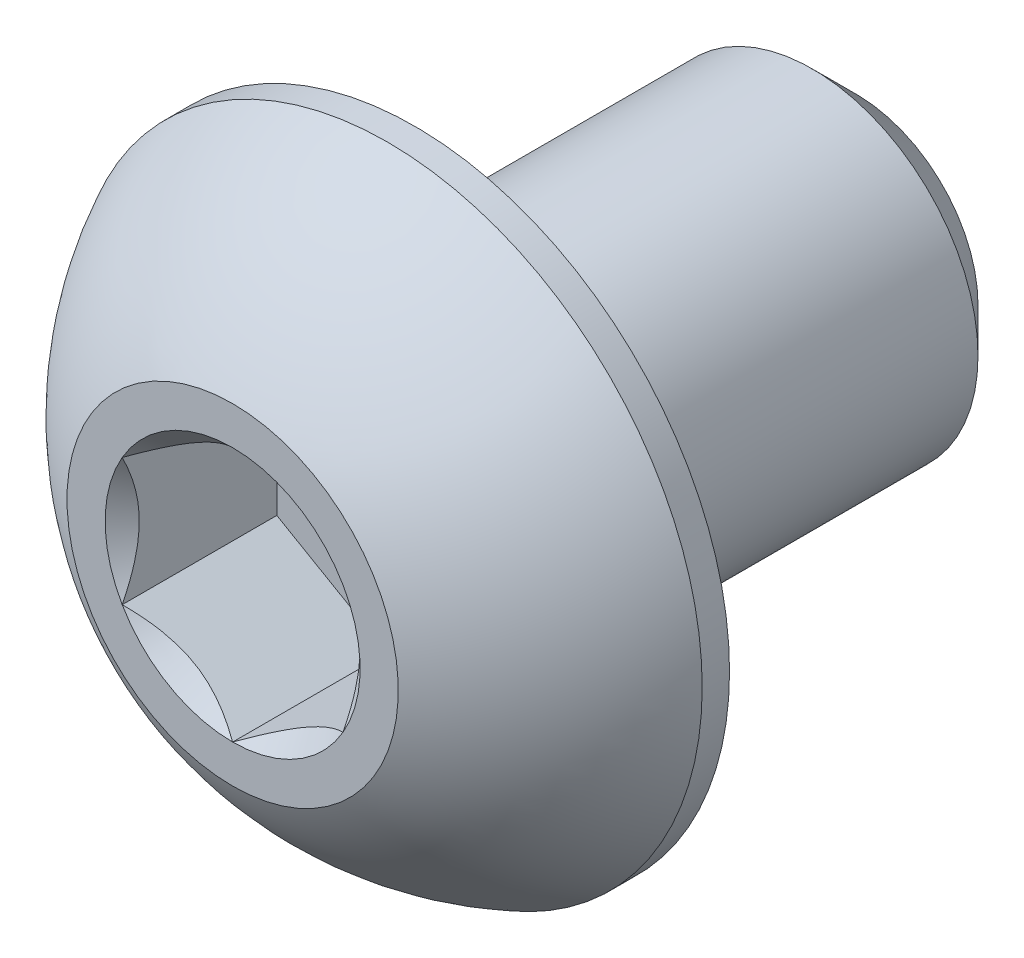
ISO-10303-21;
HEADER;
FILE_DESCRIPTION(('STEP AP214'),'2;1');
FILE_NAME('part.step','',(''),(''),'','','');
FILE_SCHEMA(('AUTOMOTIVE_DESIGN { 1 0 10303 214 1 1 1 1 }'));
ENDSEC;
DATA;
#1=APPLICATION_CONTEXT('core data for automotive mechanical design processes');
#2=APPLICATION_PROTOCOL_DEFINITION('international standard','automotive_design',2000,#1);
#3=PRODUCT_CONTEXT('',#1,'mechanical');
#4=PRODUCT('Part','Part','',(#3));
#5=PRODUCT_RELATED_PRODUCT_CATEGORY('part','',(#4));
#6=PRODUCT_DEFINITION_FORMATION('','',#4);
#7=PRODUCT_DEFINITION_CONTEXT('part definition',#1,'design');
#8=PRODUCT_DEFINITION('design','',#6,#7);
#9=PRODUCT_DEFINITION_SHAPE('','',#8);
#10=(LENGTH_UNIT() NAMED_UNIT(*) SI_UNIT(.MILLI.,.METRE.));
#11=(NAMED_UNIT(*) PLANE_ANGLE_UNIT() SI_UNIT($,.RADIAN.));
#12=(NAMED_UNIT(*) SI_UNIT($,.STERADIAN.) SOLID_ANGLE_UNIT());
#13=UNCERTAINTY_MEASURE_WITH_UNIT(LENGTH_MEASURE(1.E-05),#10,'distance_accuracy_value','');
#14=(GEOMETRIC_REPRESENTATION_CONTEXT(3) GLOBAL_UNCERTAINTY_ASSIGNED_CONTEXT((#13)) GLOBAL_UNIT_ASSIGNED_CONTEXT((#10,
#11,#12)) REPRESENTATION_CONTEXT('',''));
#15=CARTESIAN_POINT('',(0.,0.,0.));
#16=DIRECTION('',(0.,0.,1.));
#17=DIRECTION('',(1.,0.,0.));
#18=AXIS2_PLACEMENT_3D('',#15,#16,#17);
#19=CARTESIAN_POINT('',(0.,0.,2.825));
#20=DIRECTION('',(0.,0.,-1.));
#21=DIRECTION('',(-1.,0.,0.));
#22=AXIS2_PLACEMENT_3D('',#19,#20,#21);
#23=PLANE('',#22);
#24=CARTESIAN_POINT('',(0.,0.,2.825));
#25=DIRECTION('',(0.,0.,1.));
#26=DIRECTION('',(1.,0.,0.));
#27=AXIS2_PLACEMENT_3D('',#24,#25,#26);
#28=CIRCLE('',#27,1.15470053837925);
#29=CARTESIAN_POINT('',(-1.,0.577350269189626,2.825));
#30=VERTEX_POINT('',#29);
#31=CARTESIAN_POINT('',(-1.,-0.577350269189626,2.825));
#32=VERTEX_POINT('',#31);
#33=EDGE_CURVE('E134',#30,#32,#28,.T.);
#34=ORIENTED_EDGE('',*,*,#33,.F.);
#35=CARTESIAN_POINT('',(0.,1.15470053837925,2.825));
#36=VERTEX_POINT('',#35);
#37=EDGE_CURVE('E106',#36,#30,#28,.T.);
#38=ORIENTED_EDGE('',*,*,#37,.F.);
#39=CARTESIAN_POINT('',(1.,0.577350269189626,2.825));
#40=VERTEX_POINT('',#39);
#41=EDGE_CURVE('E97',#40,#36,#28,.T.);
#42=ORIENTED_EDGE('',*,*,#41,.F.);
#43=CARTESIAN_POINT('',(1.,-0.577350269189626,2.825));
#44=VERTEX_POINT('',#43);
#45=EDGE_CURVE('E58',#44,#40,#28,.T.);
#46=ORIENTED_EDGE('',*,*,#45,.F.);
#47=CARTESIAN_POINT('',(0.,-1.15470053837925,2.825));
#48=VERTEX_POINT('',#47);
#49=EDGE_CURVE('E65',#48,#44,#28,.T.);
#50=ORIENTED_EDGE('',*,*,#49,.F.);
#51=EDGE_CURVE('E135',#32,#48,#28,.T.);
#52=ORIENTED_EDGE('',*,*,#51,.F.);
#53=EDGE_LOOP('',(#34,#38,#42,#46,#50,#52));
#54=FACE_BOUND('',#53,.T.);
#55=CARTESIAN_POINT('',(0.,0.,2.825));
#56=DIRECTION('',(0.,0.,1.));
#57=DIRECTION('',(1.,0.,0.));
#58=AXIS2_PLACEMENT_3D('',#55,#56,#57);
#59=CIRCLE('',#58,1.5);
#60=CARTESIAN_POINT('',(0.,1.5,2.825));
#61=VERTEX_POINT('',#60);
#62=EDGE_CURVE('E52',#61,#61,#59,.T.);
#63=ORIENTED_EDGE('',*,*,#62,.T.);
#64=EDGE_LOOP('',(#63));
#65=FACE_BOUND('',#64,.T.);
#66=ADVANCED_FACE('F39',(#54,#65),#23,.F.);
#67=CARTESIAN_POINT('',(0.,0.,0.0301671122994625));
#68=DIRECTION('',(0.,0.,1.));
#69=DIRECTION('',(0.,1.,0.));
#70=AXIS2_PLACEMENT_3D('',#67,#68,#69);
#71=SPHERICAL_SURFACE('',#70,3.17192226735973);
#72=CARTESIAN_POINT('',(0.,0.,1.4225));
#73=DIRECTION('',(0.,0.,1.));
#74=DIRECTION('',(1.,0.,0.));
#75=AXIS2_PLACEMENT_3D('',#72,#73,#74);
#76=CIRCLE('',#75,2.85);
#77=CARTESIAN_POINT('',(0.,2.85,1.4225));
#78=VERTEX_POINT('',#77);
#79=EDGE_CURVE('E217',#78,#78,#76,.T.);
#80=CARTESIAN_POINT('',(0.,1.5,2.825));
#81=CARTESIAN_POINT('',(0.,1.5181600798921,2.81525343052663));
#82=CARTESIAN_POINT('',(0.,1.53622513742981,2.80532981527615));
#83=CARTESIAN_POINT('',(0.,1.57215840256594,2.78513236887069));
#84=CARTESIAN_POINT('',(0.,1.59002661016438,2.7748585377157));
#85=CARTESIAN_POINT('',(0.,1.6255593701915,2.75396453515098));
#86=CARTESIAN_POINT('',(0.,1.64322392262019,2.74334436374123));
#87=CARTESIAN_POINT('',(0.,1.67834266450262,2.72176172357303));
#88=CARTESIAN_POINT('',(0.,1.69579685395635,2.71079925481458));
#89=CARTESIAN_POINT('',(0.,1.73048823664554,2.68853618336439));
#90=CARTESIAN_POINT('',(0.,1.74772542988098,2.67723558067265));
#91=CARTESIAN_POINT('',(0.,1.78197627078176,2.65430053581285));
#92=CARTESIAN_POINT('',(0.,1.79898991844709,2.64266609364478));
#93=CARTESIAN_POINT('',(0.,1.83278720341135,2.61906779045309));
#94=CARTESIAN_POINT('',(0.,1.84957084071028,2.60710392942946));
#95=CARTESIAN_POINT('',(0.,1.88290172764636,2.58285133450125));
#96=CARTESIAN_POINT('',(0.,1.8994489772835,2.57056260059666));
#97=CARTESIAN_POINT('',(0.,1.93230080139369,2.54566492927458));
#98=CARTESIAN_POINT('',(0.,1.94860537586673,2.53305599185708));
#99=CARTESIAN_POINT('',(0.,1.98096565436365,2.50752270455889));
#100=CARTESIAN_POINT('',(0.,1.99702135838753,2.49459835467819));
#101=CARTESIAN_POINT('',(0.,2.02887779526296,2.46843915334777));
#102=CARTESIAN_POINT('',(0.,2.04467852811452,2.45520430189805));
#103=CARTESIAN_POINT('',(0.,2.07601901880464,2.42842912630669));
#104=CARTESIAN_POINT('',(0.,2.09155877664321,2.41488880216506));
#105=CARTESIAN_POINT('',(0.,2.12237141262985,2.38750782613789));
#106=CARTESIAN_POINT('',(0.,2.13764429077792,2.37366717425237));
#107=CARTESIAN_POINT('',(0.,2.16791736411296,2.34569080180173));
#108=CARTESIAN_POINT('',(0.,2.18291755929993,2.33155508123663));
#109=CARTESIAN_POINT('',(0.,2.21263956705414,2.30299394260905));
#110=CARTESIAN_POINT('',(0.,2.22736137962139,2.28856852454658));
#111=CARTESIAN_POINT('',(0.,2.2565210282552,2.25943347218353));
#112=CARTESIAN_POINT('',(0.,2.27095886432177,2.24472383788295));
#113=CARTESIAN_POINT('',(0.,2.2995450739765,2.21502594229721));
#114=CARTESIAN_POINT('',(0.,2.31369344756465,2.20003768101205));
#115=CARTESIAN_POINT('',(0.,2.34169535627252,2.16978822658124));
#116=CARTESIAN_POINT('',(0.,2.35554889139223,2.15452703343559));
#117=CARTESIAN_POINT('',(0.,2.38295585920366,2.12373751411442));
#118=CARTESIAN_POINT('',(0.,2.39650929189537,2.1082091879389));
#119=CARTESIAN_POINT('',(0.,2.42331090492182,2.07689130289176));
#120=CARTESIAN_POINT('',(0.,2.43655908525656,2.06110174402014));
#121=CARTESIAN_POINT('',(0.,2.46274515962755,2.02926739317577));
#122=CARTESIAN_POINT('',(0.,2.47568305366379,2.01322260120302));
#123=CARTESIAN_POINT('',(0.,2.5012436393965,1.98088388073288));
#124=CARTESIAN_POINT('',(0.,2.51386633109298,1.96458995223548));
#125=CARTESIAN_POINT('',(0.,2.53879171587278,1.9317591499574));
#126=CARTESIAN_POINT('',(0.,2.55109440895612,1.91522227617672));
#127=CARTESIAN_POINT('',(0.,2.57537512182785,1.88191186688636));
#128=CARTESIAN_POINT('',(0.,2.58735314161625,1.8651383313767));
#129=CARTESIAN_POINT('',(0.,2.61097995657956,1.83136097210576));
#130=CARTESIAN_POINT('',(0.,2.62262875175448,1.81435714834448));
#131=CARTESIAN_POINT('',(0.,2.64559269128198,1.78012567355775));
#132=CARTESIAN_POINT('',(0.,2.65690783563458,1.76289802253229));
#133=CARTESIAN_POINT('',(0.,2.67920017403639,1.72822543922701));
#134=CARTESIAN_POINT('',(0.,2.69017736808561,1.71078050694718));
#135=CARTESIAN_POINT('',(0.,2.711789634999,1.67567998980005));
#136=CARTESIAN_POINT('',(0.,2.72242470786316,1.65802440493275));
#137=CARTESIAN_POINT('',(0.,2.74334869082117,1.62250929096058));
#138=CARTESIAN_POINT('',(0.,2.75363760091502,1.60464976185571));
#139=CARTESIAN_POINT('',(0.,2.77386535089241,1.56873354659176));
#140=CARTESIAN_POINT('',(0.,2.78380419077596,1.55067686043268));
#141=CARTESIAN_POINT('',(0.,2.80332801615778,1.51437318815589));
#142=CARTESIAN_POINT('',(0.,2.81291300165605,1.49612620203818));
#143=CARTESIAN_POINT('',(0.,2.83172550494215,1.45944887791611));
#144=CARTESIAN_POINT('',(0.,2.84095302272998,1.44101853991173));
#145=CARTESIAN_POINT('',(0.,2.85,1.4225));
#146=B_SPLINE_CURVE_WITH_KNOTS('',3,(#80,#81,#82,#83,#84,#85,#86,#87,#88,#89,#90,#91,#92,#93,
#94,#95,#96,#97,#98,#99,#100,#101,#102,#103,#104,#105,#106,#107,#108,#109,#110,#111,#112,#113,
#114,#115,#116,#117,#118,#119,#120,#121,#122,#123,#124,#125,#126,#127,#128,#129,#130,#131,#132,
#133,#134,#135,#136,#137,#138,#139,#140,#141,#142,#143,#144,#145),.UNSPECIFIED.,.F.,.F.,(4,2,2,
2,2,2,2,2,2,2,2,2,2,2,2,2,2,2,2,2,2,2,2,2,2,2,2,2,2,2,2,2,4),(0.,0.0618298941826977,
0.123659788365397,0.185489682548094,0.247319576730792,0.309149470913491,0.370979365096189,
0.432809259278887,0.494639153461586,0.556469047644284,0.618298941826982,0.68012883600968,
0.741958730192378,0.803788624375077,0.865618518557774,0.927448412740472,0.989278306923171,
1.05110820110587,1.11293809528857,1.17476798947127,1.23659788365396,1.29842777783666,
1.36025767201936,1.42208756620206,1.48391746038476,1.54574735456745,1.60757724875015,
1.66940714293285,1.73123703711555,1.79306693129825,1.85489682548095,1.91672671966364,
1.97855661384634),.UNSPECIFIED.);
#147=EDGE_CURVE('BSEAM222',#61,#78,#146,.T.);
#148=ORIENTED_EDGE('',*,*,#62,.F.);
#149=ORIENTED_EDGE('',*,*,#79,.T.);
#150=ORIENTED_EDGE('',*,*,#147,.T.);
#151=ORIENTED_EDGE('',*,*,#147,.F.);
#152=EDGE_LOOP('',(#148,#150,#149,#151));
#153=FACE_BOUND('',#152,.T.);
#154=ADVANCED_FACE('F222',(#153),#71,.T.);
#155=CARTESIAN_POINT('',(0.,0.,2.825));
#156=DIRECTION('',(0.,0.,1.));
#157=DIRECTION('',(1.,0.,0.));
#158=AXIS2_PLACEMENT_3D('',#155,#156,#157);
#159=CYLINDRICAL_SURFACE('',#158,2.85);
#160=ORIENTED_EDGE('',*,*,#79,.F.);
#161=EDGE_LOOP('',(#160));
#162=FACE_BOUND('',#161,.T.);
#163=CARTESIAN_POINT('',(0.,0.,1.175));
#164=DIRECTION('',(0.,0.,1.));
#165=DIRECTION('',(1.,0.,0.));
#166=AXIS2_PLACEMENT_3D('',#163,#164,#165);
#167=CIRCLE('',#166,2.85);
#168=CARTESIAN_POINT('',(2.85,0.,1.175));
#169=VERTEX_POINT('',#168);
#170=EDGE_CURVE('E214',#169,#169,#167,.T.);
#171=ORIENTED_EDGE('',*,*,#170,.T.);
#172=EDGE_LOOP('',(#171));
#173=FACE_BOUND('',#172,.T.);
#174=ADVANCED_FACE('F225',(#162,#173),#159,.T.);
#175=CARTESIAN_POINT('',(0.,1.5,1.175));
#176=DIRECTION('',(0.,0.,1.));
#177=DIRECTION('',(1.,0.,0.));
#178=AXIS2_PLACEMENT_3D('',#175,#176,#177);
#179=PLANE('',#178);
#180=ORIENTED_EDGE('',*,*,#170,.F.);
#181=EDGE_LOOP('',(#180));
#182=FACE_BOUND('',#181,.T.);
#183=CARTESIAN_POINT('',(0.,0.,1.175));
#184=DIRECTION('',(0.,0.,1.));
#185=DIRECTION('',(1.,0.,0.));
#186=AXIS2_PLACEMENT_3D('',#183,#184,#185);
#187=CIRCLE('',#186,1.5);
#188=CARTESIAN_POINT('',(1.5,0.,1.175));
#189=VERTEX_POINT('',#188);
#190=EDGE_CURVE('E211',#189,#189,#187,.T.);
#191=ORIENTED_EDGE('',*,*,#190,.T.);
#192=EDGE_LOOP('',(#191));
#193=FACE_BOUND('',#192,.T.);
#194=ADVANCED_FACE('F230',(#182,#193),#179,.F.);
#195=CARTESIAN_POINT('',(0.,0.,2.825));
#196=DIRECTION('',(0.,0.,1.));
#197=DIRECTION('',(1.,0.,0.));
#198=AXIS2_PLACEMENT_3D('',#195,#196,#197);
#199=CYLINDRICAL_SURFACE('',#198,1.5);
#200=ORIENTED_EDGE('',*,*,#190,.F.);
#201=EDGE_LOOP('',(#200));
#202=FACE_BOUND('',#201,.T.);
#203=CARTESIAN_POINT('',(0.,0.,-2.425));
#204=DIRECTION('',(0.,0.,1.));
#205=DIRECTION('',(1.,0.,0.));
#206=AXIS2_PLACEMENT_3D('',#203,#204,#205);
#207=CIRCLE('',#206,1.5);
#208=CARTESIAN_POINT('',(1.5,0.,-2.425));
#209=VERTEX_POINT('',#208);
#210=EDGE_CURVE('E208',#209,#209,#207,.T.);
#211=ORIENTED_EDGE('',*,*,#210,.T.);
#212=EDGE_LOOP('',(#211));
#213=FACE_BOUND('',#212,.T.);
#214=ADVANCED_FACE('F236',(#202,#213),#199,.T.);
#215=CARTESIAN_POINT('',(0.,0.,-2.825));
#216=DIRECTION('',(0.,0.,1.));
#217=DIRECTION('',(1.,0.,0.));
#218=AXIS2_PLACEMENT_3D('',#215,#216,#217);
#219=CONICAL_SURFACE('',#218,1.1,0.785398163397444);
#220=ORIENTED_EDGE('',*,*,#210,.F.);
#221=EDGE_LOOP('',(#220));
#222=FACE_BOUND('',#221,.T.);
#223=CARTESIAN_POINT('',(0.,0.,-2.825));
#224=DIRECTION('',(0.,0.,1.));
#225=DIRECTION('',(1.,0.,0.));
#226=AXIS2_PLACEMENT_3D('',#223,#224,#225);
#227=CIRCLE('',#226,1.1);
#228=CARTESIAN_POINT('',(1.1,0.,-2.825));
#229=VERTEX_POINT('',#228);
#230=EDGE_CURVE('E195',#229,#229,#227,.T.);
#231=ORIENTED_EDGE('',*,*,#230,.T.);
#232=EDGE_LOOP('',(#231));
#233=FACE_BOUND('',#232,.T.);
#234=ADVANCED_FACE('F242',(#222,#233),#219,.T.);
#235=CARTESIAN_POINT('',(0.,0.,-2.825));
#236=DIRECTION('',(0.,0.,1.));
#237=DIRECTION('',(1.,0.,0.));
#238=AXIS2_PLACEMENT_3D('',#235,#236,#237);
#239=PLANE('',#238);
#240=ORIENTED_EDGE('',*,*,#230,.F.);
#241=EDGE_LOOP('',(#240));
#242=FACE_BOUND('',#241,.T.);
#243=ADVANCED_FACE('F168',(#242),#239,.F.);
#244=CARTESIAN_POINT('',(0.,0.,2.825));
#245=DIRECTION('',(0.,0.,1.));
#246=DIRECTION('',(1.,0.,0.));
#247=AXIS2_PLACEMENT_3D('',#244,#245,#246);
#248=CONICAL_SURFACE('',#247,1.15470053837925,0.78539816339745);
#249=ORIENTED_EDGE('',*,*,#37,.T.);
#250=CARTESIAN_POINT('',(0.000200000000000047,1.15481600843309,2.82511548737261));
#251=CARTESIAN_POINT('',(-0.0341825950071806,1.13496520795026,2.80527793082573));
#252=CARTESIAN_POINT('',(-0.0691401181398248,1.11478247255942,2.78660502063889));
#253=CARTESIAN_POINT('',(-0.14042280295609,1.07362739529219,2.75241474272316));
#254=CARTESIAN_POINT('',(-0.176754750528984,1.0526511355808,2.73691640902346));
#255=CARTESIAN_POINT('',(-0.250016613803311,1.01035337909803,2.71036730714227));
#256=CARTESIAN_POINT('',(-0.286927851445414,0.989042666109241,2.69924977399693));
#257=CARTESIAN_POINT('',(-0.361562729310859,0.945952199282692,2.68211986577618));
#258=CARTESIAN_POINT('',(-0.399284088108636,0.924173762626597,2.67609469746667));
#259=CARTESIAN_POINT('',(-0.464292198417934,0.886641312640015,2.67066055496749));
#260=CARTESIAN_POINT('',(-0.491494371528172,0.870936130672276,2.66985693831673));
#261=CARTESIAN_POINT('',(-0.545846040669112,0.839556179862849,2.67120669941689));
#262=CARTESIAN_POINT('',(-0.572995523754876,0.823881418494924,2.6733607295472));
#263=CARTESIAN_POINT('',(-0.65405627732696,0.777080970599367,2.68411697212847));
#264=CARTESIAN_POINT('',(-0.707564140978427,0.746188191116431,2.69701455641536));
#265=CARTESIAN_POINT('',(-0.801476065143432,0.69196811641965,2.72814073060218));
#266=CARTESIAN_POINT('',(-0.842320523671834,0.668386557293372,2.74473779770184));
#267=CARTESIAN_POINT('',(-0.922409637381944,0.622147085933682,2.78212492468529));
#268=CARTESIAN_POINT('',(-0.961659010870438,0.599486449584576,2.8029013418174));
#269=CARTESIAN_POINT('',(-1.0002,0.577234799135789,2.82511548737261));
#270=B_SPLINE_CURVE_WITH_KNOTS('',3,(#250,#251,#252,#253,#254,#255,#256,#257,#258,#259,#260,
#261,#262,#263,#264,#265,#266,#267,#268,#269),.UNSPECIFIED.,.F.,.F.,(4,2,2,2,2,2,2,2,2,4),(0.,
0.133237676828559,0.26725222983449,0.3991370762693,0.530689603280768,0.624814864263846,
0.718960890149133,0.907306626112098,1.05710100361789,1.20641411519286),.UNSPECIFIED.);
#271=EDGE_CURVE('E11',#36,#30,#270,.T.);
#272=ORIENTED_EDGE('',*,*,#271,.F.);
#273=EDGE_LOOP('',(#249,#272));
#274=FACE_BOUND('',#273,.T.);
#275=ADVANCED_FACE('F110',(#274),#248,.F.);
#276=ORIENTED_EDGE('',*,*,#33,.T.);
#277=CARTESIAN_POINT('',(-1.,-1.15147208646462,3.19538567751386));
#278=CARTESIAN_POINT('',(-1.,-1.12343447988552,3.17421991987371));
#279=CARTESIAN_POINT('',(-1.,-1.09524064850697,3.15326169217591));
#280=CARTESIAN_POINT('',(-1.,-1.03847715644376,3.11184602223562));
#281=CARTESIAN_POINT('',(-1.,-1.00990740382975,3.09138870612366));
#282=CARTESIAN_POINT('',(-1.,-0.923120894333476,3.03060479495451));
#283=CARTESIAN_POINT('',(-1.,-0.864253173759059,2.9911922289614));
#284=CARTESIAN_POINT('',(-1.,-0.740809858258045,2.9138206642002));
#285=CARTESIAN_POINT('',(-1.,-0.676100255137807,2.87607303911434));
#286=CARTESIAN_POINT('',(-1.,-0.543448939049124,2.80702458755129));
#287=CARTESIAN_POINT('',(-1.,-0.475519112027779,2.77570202784686));
#288=CARTESIAN_POINT('',(-1.,-0.373555850333529,2.73738177888379));
#289=CARTESIAN_POINT('',(-1.,-0.341031989670907,2.72638359164216));
#290=CARTESIAN_POINT('',(-1.,-0.275199079052293,2.70699834214736));
#291=CARTESIAN_POINT('',(-1.,-0.241889975173933,2.6986114597767));
#292=CARTESIAN_POINT('',(-1.,-0.175247517042993,2.68502522071902));
#293=CARTESIAN_POINT('',(-1.,-0.141925568218175,2.67977079076797));
#294=CARTESIAN_POINT('',(-1.,-0.0749144362322789,2.67254868657089));
#295=CARTESIAN_POINT('',(-1.,-0.0412251978501617,2.67058151361051));
#296=CARTESIAN_POINT('',(-1.,0.0249580992634211,2.67008319839316));
#297=CARTESIAN_POINT('',(-1.,0.0574512826460395,2.67143026788863));
#298=CARTESIAN_POINT('',(-1.,0.122148505701867,2.67721648449898));
#299=CARTESIAN_POINT('',(-1.,0.154352610132927,2.68165492066153));
#300=CARTESIAN_POINT('',(-1.,0.21879989886764,2.6934568301452));
#301=CARTESIAN_POINT('',(-1.,0.251033743268954,2.70087054103851));
#302=CARTESIAN_POINT('',(-1.,0.314797132354919,2.71822894249867));
#303=CARTESIAN_POINT('',(-1.,0.346326735731004,2.72817342128883));
#304=CARTESIAN_POINT('',(-1.,0.445594187730205,2.76322348255434));
#305=CARTESIAN_POINT('',(-1.,0.511919139476036,2.79232085835672));
#306=CARTESIAN_POINT('',(-1.,0.641453244657532,2.8570153296865));
#307=CARTESIAN_POINT('',(-1.,0.704650133126344,2.89263577671524));
#308=CARTESIAN_POINT('',(-1.,0.825428490174986,2.96612390134693));
#309=CARTESIAN_POINT('',(-1.,0.883132947867684,3.00379194713546));
#310=CARTESIAN_POINT('',(-1.,0.968148853704565,3.06202285294316));
#311=CARTESIAN_POINT('',(-1.,0.996120570380284,3.08163847576285));
#312=CARTESIAN_POINT('',(-1.,1.05168177729901,3.12138851706127));
#313=CARTESIAN_POINT('',(-1.,1.079271369977,3.14152279219883));
#314=CARTESIAN_POINT('',(-1.,1.10670185346329,3.16187211907297));
#315=B_SPLINE_CURVE_WITH_KNOTS('',3,(#277,#278,#279,#280,#281,#282,#283,#284,#285,#286,#287,
#288,#289,#290,#291,#292,#293,#294,#295,#296,#297,#298,#299,#300,#301,#302,#303,#304,#305,#306,
#307,#308,#309,#310,#311,#312,#313,#314),.UNSPECIFIED.,.F.,.F.,(4,2,2,2,2,2,2,2,2,2,2,2,2,2,2,2,
2,2,4),(0.,0.10538645908329,0.210799187330124,0.423233611565468,0.647793540908503,
0.871580877738609,0.97449307418142,1.07741235827201,1.17846428203205,1.27953161415762,
1.3769408673961,1.47432772585408,1.57343322804293,1.67253043972851,1.88917353996827,
2.10660791038813,2.31323734249843,2.41572589232044,2.51818641476503),.UNSPECIFIED.);
#316=EDGE_CURVE('E105',#30,#32,#315,.F.);
#317=ORIENTED_EDGE('',*,*,#316,.F.);
#318=EDGE_LOOP('',(#276,#317));
#319=FACE_BOUND('',#318,.T.);
#320=ADVANCED_FACE('F255',(#319),#248,.F.);
#321=ORIENTED_EDGE('',*,*,#51,.T.);
#322=CARTESIAN_POINT('',(-1.0002,-0.577234799135788,2.82511548737261));
#323=CARTESIAN_POINT('',(-0.965817404992819,-0.597085599618621,2.80527793082573));
#324=CARTESIAN_POINT('',(-0.930859881860175,-0.617268335009456,2.78660502063889));
#325=CARTESIAN_POINT('',(-0.85957719704391,-0.658423412276686,2.75241474272316));
#326=CARTESIAN_POINT('',(-0.823245249471016,-0.67939967198808,2.73691640902346));
#327=CARTESIAN_POINT('',(-0.749983386196689,-0.721697428470846,2.71036730714226));
#328=CARTESIAN_POINT('',(-0.713072148554586,-0.743008141459636,2.69924977399693));
#329=CARTESIAN_POINT('',(-0.638437270689141,-0.786098608286186,2.68211986577618));
#330=CARTESIAN_POINT('',(-0.600715911891364,-0.807877044942281,2.67609469746667));
#331=CARTESIAN_POINT('',(-0.535707801582067,-0.845409494928862,2.67066055496749));
#332=CARTESIAN_POINT('',(-0.508505628471828,-0.861114676896601,2.66985693831673));
#333=CARTESIAN_POINT('',(-0.454153959330888,-0.892494627706028,2.67120669941689));
#334=CARTESIAN_POINT('',(-0.427004476245125,-0.908169389073953,2.6733607295472));
#335=CARTESIAN_POINT('',(-0.34594372267304,-0.95496983696951,2.68411697212847));
#336=CARTESIAN_POINT('',(-0.292435859021573,-0.985862616452447,2.69701455641535));
#337=CARTESIAN_POINT('',(-0.198523934856569,-1.04008269114923,2.72814073060218));
#338=CARTESIAN_POINT('',(-0.157679476328166,-1.06366425027551,2.74473779770184));
#339=CARTESIAN_POINT('',(-0.0775903626180565,-1.1099037216352,2.78212492468529));
#340=CARTESIAN_POINT('',(-0.0383409891295625,-1.1325643579843,2.8029013418174));
#341=CARTESIAN_POINT('',(0.000199999999999785,-1.15481600843309,2.82511548737261));
#342=B_SPLINE_CURVE_WITH_KNOTS('',3,(#322,#323,#324,#325,#326,#327,#328,#329,#330,#331,#332,
#333,#334,#335,#336,#337,#338,#339,#340,#341),.UNSPECIFIED.,.F.,.F.,(4,2,2,2,2,2,2,2,2,4),(0.,
0.133237676828559,0.26725222983449,0.3991370762693,0.530689603280768,0.624814864263846,
0.718960890149133,0.907306626112097,1.05710100361789,1.20641411519286),.UNSPECIFIED.);
#343=EDGE_CURVE('E144',#32,#48,#342,.T.);
#344=ORIENTED_EDGE('',*,*,#343,.F.);
#345=EDGE_LOOP('',(#321,#344));
#346=FACE_BOUND('',#345,.T.);
#347=ADVANCED_FACE('F272',(#346),#248,.F.);
#348=ORIENTED_EDGE('',*,*,#49,.T.);
#349=CARTESIAN_POINT('',(-0.000200000000000145,-1.15481600843309,2.82511548737261));
#350=CARTESIAN_POINT('',(0.0341825950071804,-1.13496520795026,2.80527793082573));
#351=CARTESIAN_POINT('',(0.0691401181398246,-1.11478247255942,2.78660502063889));
#352=CARTESIAN_POINT('',(0.140422802956089,-1.07362739529219,2.75241474272316));
#353=CARTESIAN_POINT('',(0.176754750528984,-1.0526511355808,2.73691640902346));
#354=CARTESIAN_POINT('',(0.250016613803311,-1.01035337909803,2.71036730714226));
#355=CARTESIAN_POINT('',(0.286927851445414,-0.98904266610924,2.69924977399692));
#356=CARTESIAN_POINT('',(0.361562729310859,-0.945952199282691,2.68211986577618));
#357=CARTESIAN_POINT('',(0.399284088108636,-0.924173762626596,2.67609469746667));
#358=CARTESIAN_POINT('',(0.464292198417933,-0.886641312640014,2.67066055496749));
#359=CARTESIAN_POINT('',(0.491494371528172,-0.870936130672275,2.66985693831673));
#360=CARTESIAN_POINT('',(0.545846040669112,-0.839556179862848,2.67120669941689));
#361=CARTESIAN_POINT('',(0.572995523754876,-0.823881418494923,2.6733607295472));
#362=CARTESIAN_POINT('',(0.65405627732696,-0.777080970599366,2.68411697212847));
#363=CARTESIAN_POINT('',(0.707564140978427,-0.74618819111643,2.69701455641535));
#364=CARTESIAN_POINT('',(0.801476065143431,-0.691968116419649,2.72814073060218));
#365=CARTESIAN_POINT('',(0.842320523671834,-0.668386557293371,2.74473779770184));
#366=CARTESIAN_POINT('',(0.922409637381944,-0.622147085933681,2.78212492468529));
#367=CARTESIAN_POINT('',(0.961659010870438,-0.599486449584575,2.8029013418174));
#368=CARTESIAN_POINT('',(1.0002,-0.577234799135788,2.82511548737261));
#369=B_SPLINE_CURVE_WITH_KNOTS('',3,(#349,#350,#351,#352,#353,#354,#355,#356,#357,#358,#359,
#360,#361,#362,#363,#364,#365,#366,#367,#368),.UNSPECIFIED.,.F.,.F.,(4,2,2,2,2,2,2,2,2,4),(0.,
0.133237676828559,0.26725222983449,0.3991370762693,0.530689603280768,0.624814864263846,
0.718960890149133,0.907306626112097,1.05710100361789,1.20641411519286),.UNSPECIFIED.);
#370=EDGE_CURVE('E352',#48,#44,#369,.T.);
#371=ORIENTED_EDGE('',*,*,#370,.F.);
#372=EDGE_LOOP('',(#348,#371));
#373=FACE_BOUND('',#372,.T.);
#374=ADVANCED_FACE('F279',(#373),#248,.F.);
#375=ORIENTED_EDGE('',*,*,#45,.T.);
#376=CARTESIAN_POINT('',(1.,-1.15147208663215,3.19538567764035));
#377=CARTESIAN_POINT('',(1.,-1.12343448004835,3.17421991999533));
#378=CARTESIAN_POINT('',(1.,-1.09524064866509,3.15326169229266));
#379=CARTESIAN_POINT('',(1.,-1.0384771565924,3.11184602234267));
#380=CARTESIAN_POINT('',(1.,-1.00990740397362,3.09138870622587));
#381=CARTESIAN_POINT('',(1.,-0.923120894462775,3.03060479504212));
#382=CARTESIAN_POINT('',(1.,-0.864253173878444,2.99119222903932));
#383=CARTESIAN_POINT('',(1.,-0.74080985835581,2.91382066425819));
#384=CARTESIAN_POINT('',(1.,-0.676100255223808,2.87607303916216));
#385=CARTESIAN_POINT('',(1.,-0.543448939110597,2.80702458758025));
#386=CARTESIAN_POINT('',(1.,-0.475519112076495,2.77570202786713));
#387=CARTESIAN_POINT('',(1.,-0.373555850372648,2.7373817788976));
#388=CARTESIAN_POINT('',(1.,-0.341031989714046,2.72638359165621));
#389=CARTESIAN_POINT('',(1.,-0.275199079103601,2.70699834216111));
#390=CARTESIAN_POINT('',(1.,-0.241889975229392,2.69861145978989));
#391=CARTESIAN_POINT('',(1.,-0.175247517106615,2.68502522073014));
#392=CARTESIAN_POINT('',(1.,-0.141925568285807,2.67977079077761));
#393=CARTESIAN_POINT('',(1.,-0.0749144363078009,2.67254868657667));
#394=CARTESIAN_POINT('',(1.,-0.0412251979295626,2.67058151361391));
#395=CARTESIAN_POINT('',(1.,0.0249580991768645,2.67008319839111));
#396=CARTESIAN_POINT('',(1.,0.057451282556196,2.67143026788357));
#397=CARTESIAN_POINT('',(1.,0.122148505605779,2.67721648448742));
#398=CARTESIAN_POINT('',(1.,0.154352610033881,2.68165492064648));
#399=CARTESIAN_POINT('',(1.,0.218799898762755,2.69345683012285));
#400=CARTESIAN_POINT('',(1.,0.251033743161196,2.70087054101231));
#401=CARTESIAN_POINT('',(1.,0.314797132241694,2.71822894246471));
#402=CARTESIAN_POINT('',(1.,0.346326735615184,2.72817342125094));
#403=CARTESIAN_POINT('',(1.,0.445594187589164,2.76322348249794));
#404=CARTESIAN_POINT('',(1.,0.511919139313635,2.7923208582833));
#405=CARTESIAN_POINT('',(1.,0.641453244454049,2.85701532957715));
#406=CARTESIAN_POINT('',(1.,0.704650132903151,2.89263577658696));
#407=CARTESIAN_POINT('',(1.,0.825428489916356,2.96612390118245));
#408=CARTESIAN_POINT('',(1.,0.883132947593201,3.00379194695385));
#409=CARTESIAN_POINT('',(1.,0.968148853406641,3.06202285273595));
#410=CARTESIAN_POINT('',(1.,0.99612057007466,3.08163847554718));
#411=CARTESIAN_POINT('',(1.,1.05168177697804,3.12138851682867));
#412=CARTESIAN_POINT('',(1.,1.07927136964838,3.14152279195778));
#413=CARTESIAN_POINT('',(1.,1.10670185312703,3.16187211882347));
#414=B_SPLINE_CURVE_WITH_KNOTS('',3,(#376,#377,#378,#379,#380,#381,#382,#383,#384,#385,#386,
#387,#388,#389,#390,#391,#392,#393,#394,#395,#396,#397,#398,#399,#400,#401,#402,#403,#404,#405,
#406,#407,#408,#409,#410,#411,#412,#413),.UNSPECIFIED.,.F.,.F.,(4,2,2,2,2,2,2,2,2,2,2,2,2,2,2,2,
2,2,4),(0.,0.10538645910335,0.210799187370249,0.423233611646473,0.647793541035351,
0.871580877910865,0.974493074342054,1.07741235842104,1.17846428216995,1.27953161428439,
1.37694086751269,1.47432772596047,1.57343322813835,1.67253043981296,1.88917353997386,
2.10660791031433,2.31323734235672,2.41572589214523,2.51818641455632),.UNSPECIFIED.);
#415=EDGE_CURVE('E122',#44,#40,#414,.T.);
#416=ORIENTED_EDGE('',*,*,#415,.F.);
#417=EDGE_LOOP('',(#375,#416));
#418=FACE_BOUND('',#417,.T.);
#419=ADVANCED_FACE('F286',(#418),#248,.F.);
#420=ORIENTED_EDGE('',*,*,#41,.T.);
#421=CARTESIAN_POINT('',(1.0002,0.577234799135789,2.82511548737261));
#422=CARTESIAN_POINT('',(0.965817404992819,0.597085599618622,2.80527793082573));
#423=CARTESIAN_POINT('',(0.930859881860175,0.617268335009457,2.78660502063889));
#424=CARTESIAN_POINT('',(0.859577197043911,0.658423412276686,2.75241474272316));
#425=CARTESIAN_POINT('',(0.823245249471016,0.67939967198808,2.73691640902346));
#426=CARTESIAN_POINT('',(0.749983386196689,0.721697428470847,2.71036730714227));
#427=CARTESIAN_POINT('',(0.713072148554586,0.743008141459637,2.69924977399693));
#428=CARTESIAN_POINT('',(0.638437270689141,0.786098608286186,2.68211986577618));
#429=CARTESIAN_POINT('',(0.600715911891365,0.807877044942281,2.67609469746667));
#430=CARTESIAN_POINT('',(0.535707801582067,0.845409494928863,2.67066055496749));
#431=CARTESIAN_POINT('',(0.508505628471829,0.861114676896602,2.66985693831673));
#432=CARTESIAN_POINT('',(0.454153959330889,0.892494627706029,2.67120669941689));
#433=CARTESIAN_POINT('',(0.427004476245125,0.908169389073954,2.6733607295472));
#434=CARTESIAN_POINT('',(0.34594372267304,0.954969836969511,2.68411697212847));
#435=CARTESIAN_POINT('',(0.292435859021573,0.985862616452447,2.69701455641536));
#436=CARTESIAN_POINT('',(0.198523934856569,1.04008269114923,2.72814073060218));
#437=CARTESIAN_POINT('',(0.157679476328166,1.06366425027551,2.74473779770184));
#438=CARTESIAN_POINT('',(0.0775903626180566,1.1099037216352,2.78212492468529));
#439=CARTESIAN_POINT('',(0.0383409891295624,1.1325643579843,2.8029013418174));
#440=CARTESIAN_POINT('',(-0.000199999999999812,1.15481600843309,2.82511548737261));
#441=B_SPLINE_CURVE_WITH_KNOTS('',3,(#421,#422,#423,#424,#425,#426,#427,#428,#429,#430,#431,
#432,#433,#434,#435,#436,#437,#438,#439,#440),.UNSPECIFIED.,.F.,.F.,(4,2,2,2,2,2,2,2,2,4),(0.,
0.133237676828559,0.267252229834489,0.399137076269299,0.530689603280767,0.624814864263845,
0.718960890149132,0.907306626112096,1.05710100361789,1.20641411519286),.UNSPECIFIED.);
#442=EDGE_CURVE('E101',#40,#36,#441,.T.);
#443=ORIENTED_EDGE('',*,*,#442,.F.);
#444=EDGE_LOOP('',(#420,#443));
#445=FACE_BOUND('',#444,.T.);
#446=ADVANCED_FACE('F99',(#445),#248,.F.);
#447=CARTESIAN_POINT('',(0.,0.,1.425));
#448=DIRECTION('',(0.,0.,1.));
#449=DIRECTION('',(1.,0.,0.));
#450=AXIS2_PLACEMENT_3D('',#447,#448,#449);
#451=PLANE('',#450);
#452=DIRECTION('',(-0.866025403784439,0.5,0.));
#453=VECTOR('',#452,1.);
#454=CARTESIAN_POINT('',(1.,0.577350269189626,1.425));
#455=LINE('',#454,#453);
#456=CARTESIAN_POINT('',(1.,0.577350269189626,1.425));
#457=VERTEX_POINT('',#456);
#458=CARTESIAN_POINT('',(0.,1.15470053837925,1.425));
#459=VERTEX_POINT('',#458);
#460=EDGE_CURVE('E121',#457,#459,#455,.T.);
#461=ORIENTED_EDGE('',*,*,#460,.T.);
#462=DIRECTION('',(-0.866025403784439,-0.5,0.));
#463=VECTOR('',#462,1.);
#464=CARTESIAN_POINT('',(0.,1.15470053837925,1.425));
#465=LINE('',#464,#463);
#466=CARTESIAN_POINT('',(-1.,0.577350269189626,1.425));
#467=VERTEX_POINT('',#466);
#468=EDGE_CURVE('E126',#459,#467,#465,.T.);
#469=ORIENTED_EDGE('',*,*,#468,.T.);
#470=DIRECTION('',(0.,-1.,0.));
#471=VECTOR('',#470,1.);
#472=CARTESIAN_POINT('',(-1.,0.577350269189626,1.425));
#473=LINE('',#472,#471);
#474=CARTESIAN_POINT('',(-1.,-0.577350269189625,1.425));
#475=VERTEX_POINT('',#474);
#476=EDGE_CURVE('E183',#467,#475,#473,.T.);
#477=ORIENTED_EDGE('',*,*,#476,.T.);
#478=DIRECTION('',(0.866025403784438,-0.5,0.));
#479=VECTOR('',#478,1.);
#480=CARTESIAN_POINT('',(-1.,-0.577350269189625,1.425));
#481=LINE('',#480,#479);
#482=CARTESIAN_POINT('',(0.,-1.15470053837925,1.425));
#483=VERTEX_POINT('',#482);
#484=EDGE_CURVE('E186',#475,#483,#481,.T.);
#485=ORIENTED_EDGE('',*,*,#484,.T.);
#486=DIRECTION('',(0.866025403784439,0.5,0.));
#487=VECTOR('',#486,1.);
#488=CARTESIAN_POINT('',(0.,-1.15470053837925,1.425));
#489=LINE('',#488,#487);
#490=CARTESIAN_POINT('',(1.,-0.577350269189626,1.425));
#491=VERTEX_POINT('',#490);
#492=EDGE_CURVE('E189',#483,#491,#489,.T.);
#493=ORIENTED_EDGE('',*,*,#492,.T.);
#494=DIRECTION('',(0.,1.,0.));
#495=VECTOR('',#494,1.);
#496=CARTESIAN_POINT('',(1.,-0.577350269189626,1.425));
#497=LINE('',#496,#495);
#498=EDGE_CURVE('E129',#491,#457,#497,.T.);
#499=ORIENTED_EDGE('',*,*,#498,.T.);
#500=EDGE_LOOP('',(#461,#469,#477,#485,#493,#499));
#501=FACE_BOUND('',#500,.T.);
#502=ADVANCED_FACE('F163',(#501),#451,.T.);
#503=CARTESIAN_POINT('',(0.,1.15470053837925,1.425));
#504=DIRECTION('',(-0.5,0.866025403784439,0.));
#505=DIRECTION('',(-0.866025403784439,-0.5,0.));
#506=AXIS2_PLACEMENT_3D('',#503,#504,#505);
#507=PLANE('',#506);
#508=DIRECTION('',(0.,0.,1.));
#509=VECTOR('',#508,1.);
#510=CARTESIAN_POINT('',(0.,1.15470053837925,1.425));
#511=LINE('',#510,#509);
#512=EDGE_CURVE('E118',#459,#36,#511,.T.);
#513=ORIENTED_EDGE('',*,*,#512,.T.);
#514=ORIENTED_EDGE('',*,*,#271,.T.);
#515=DIRECTION('',(0.,0.,1.));
#516=VECTOR('',#515,1.);
#517=CARTESIAN_POINT('',(-1.,0.577350269189626,1.425));
#518=LINE('',#517,#516);
#519=EDGE_CURVE('E128',#467,#30,#518,.T.);
#520=ORIENTED_EDGE('',*,*,#519,.F.);
#521=ORIENTED_EDGE('',*,*,#468,.F.);
#522=EDGE_LOOP('',(#513,#514,#520,#521));
#523=FACE_BOUND('',#522,.T.);
#524=ADVANCED_FACE('F124',(#523),#507,.F.);
#525=CARTESIAN_POINT('',(-1.,0.577350269189626,1.425));
#526=DIRECTION('',(-1.,0.,0.));
#527=DIRECTION('',(0.,0.,1.));
#528=AXIS2_PLACEMENT_3D('',#525,#526,#527);
#529=PLANE('',#528);
#530=ORIENTED_EDGE('',*,*,#519,.T.);
#531=ORIENTED_EDGE('',*,*,#316,.T.);
#532=DIRECTION('',(0.,0.,1.));
#533=VECTOR('',#532,1.);
#534=CARTESIAN_POINT('',(-1.,-0.577350269189625,1.425));
#535=LINE('',#534,#533);
#536=EDGE_CURVE('E202',#475,#32,#535,.T.);
#537=ORIENTED_EDGE('',*,*,#536,.F.);
#538=ORIENTED_EDGE('',*,*,#476,.F.);
#539=EDGE_LOOP('',(#530,#531,#537,#538));
#540=FACE_BOUND('',#539,.T.);
#541=ADVANCED_FACE('F153',(#540),#529,.F.);
#542=CARTESIAN_POINT('',(-1.,-0.577350269189625,1.425));
#543=DIRECTION('',(-0.5,-0.866025403784438,0.));
#544=DIRECTION('',(0.866025403784439,-0.5,0.));
#545=AXIS2_PLACEMENT_3D('',#542,#543,#544);
#546=PLANE('',#545);
#547=ORIENTED_EDGE('',*,*,#536,.T.);
#548=ORIENTED_EDGE('',*,*,#343,.T.);
#549=DIRECTION('',(0.,0.,1.));
#550=VECTOR('',#549,1.);
#551=CARTESIAN_POINT('',(0.,-1.15470053837925,1.425));
#552=LINE('',#551,#550);
#553=EDGE_CURVE('E199',#483,#48,#552,.T.);
#554=ORIENTED_EDGE('',*,*,#553,.F.);
#555=ORIENTED_EDGE('',*,*,#484,.F.);
#556=EDGE_LOOP('',(#547,#548,#554,#555));
#557=FACE_BOUND('',#556,.T.);
#558=ADVANCED_FACE('F156',(#557),#546,.F.);
#559=CARTESIAN_POINT('',(0.,-1.15470053837925,1.425));
#560=DIRECTION('',(0.5,-0.866025403784439,0.));
#561=DIRECTION('',(0.866025403784439,0.5,0.));
#562=AXIS2_PLACEMENT_3D('',#559,#560,#561);
#563=PLANE('',#562);
#564=ORIENTED_EDGE('',*,*,#553,.T.);
#565=ORIENTED_EDGE('',*,*,#370,.T.);
#566=DIRECTION('',(0.,0.,1.));
#567=VECTOR('',#566,1.);
#568=CARTESIAN_POINT('',(1.,-0.577350269189626,1.425));
#569=LINE('',#568,#567);
#570=EDGE_CURVE('E196',#491,#44,#569,.T.);
#571=ORIENTED_EDGE('',*,*,#570,.F.);
#572=ORIENTED_EDGE('',*,*,#492,.F.);
#573=EDGE_LOOP('',(#564,#565,#571,#572));
#574=FACE_BOUND('',#573,.T.);
#575=ADVANCED_FACE('F310',(#574),#563,.F.);
#576=CARTESIAN_POINT('',(1.,-0.577350269189626,1.425));
#577=DIRECTION('',(1.,0.,0.));
#578=DIRECTION('',(0.,1.,0.));
#579=AXIS2_PLACEMENT_3D('',#576,#577,#578);
#580=PLANE('',#579);
#581=ORIENTED_EDGE('',*,*,#570,.T.);
#582=ORIENTED_EDGE('',*,*,#415,.T.);
#583=DIRECTION('',(0.,0.,1.));
#584=VECTOR('',#583,1.);
#585=CARTESIAN_POINT('',(1.,0.577350269189626,1.425));
#586=LINE('',#585,#584);
#587=EDGE_CURVE('E120',#457,#40,#586,.T.);
#588=ORIENTED_EDGE('',*,*,#587,.F.);
#589=ORIENTED_EDGE('',*,*,#498,.F.);
#590=EDGE_LOOP('',(#581,#582,#588,#589));
#591=FACE_BOUND('',#590,.T.);
#592=ADVANCED_FACE('F167',(#591),#580,.F.);
#593=CARTESIAN_POINT('',(1.,0.577350269189626,1.425));
#594=DIRECTION('',(0.5,0.866025403784439,0.));
#595=DIRECTION('',(-0.866025403784439,0.5,0.));
#596=AXIS2_PLACEMENT_3D('',#593,#594,#595);
#597=PLANE('',#596);
#598=ORIENTED_EDGE('',*,*,#587,.T.);
#599=ORIENTED_EDGE('',*,*,#442,.T.);
#600=ORIENTED_EDGE('',*,*,#512,.F.);
#601=ORIENTED_EDGE('',*,*,#460,.F.);
#602=EDGE_LOOP('',(#598,#599,#600,#601));
#603=FACE_BOUND('',#602,.T.);
#604=ADVANCED_FACE('F116',(#603),#597,.F.);
#605=CLOSED_SHELL('',(#66,#154,#174,#194,#214,#234,#243,#275,#320,#347,#374,#419,#446,#502,#524,
#541,#558,#575,#592,#604));
#606=MANIFOLD_SOLID_BREP('B2',#605);
#607=ADVANCED_BREP_SHAPE_REPRESENTATION('',(#18,#606),#14);
#608=SHAPE_DEFINITION_REPRESENTATION(#9,#607);
ENDSEC;
END-ISO-10303-21;
